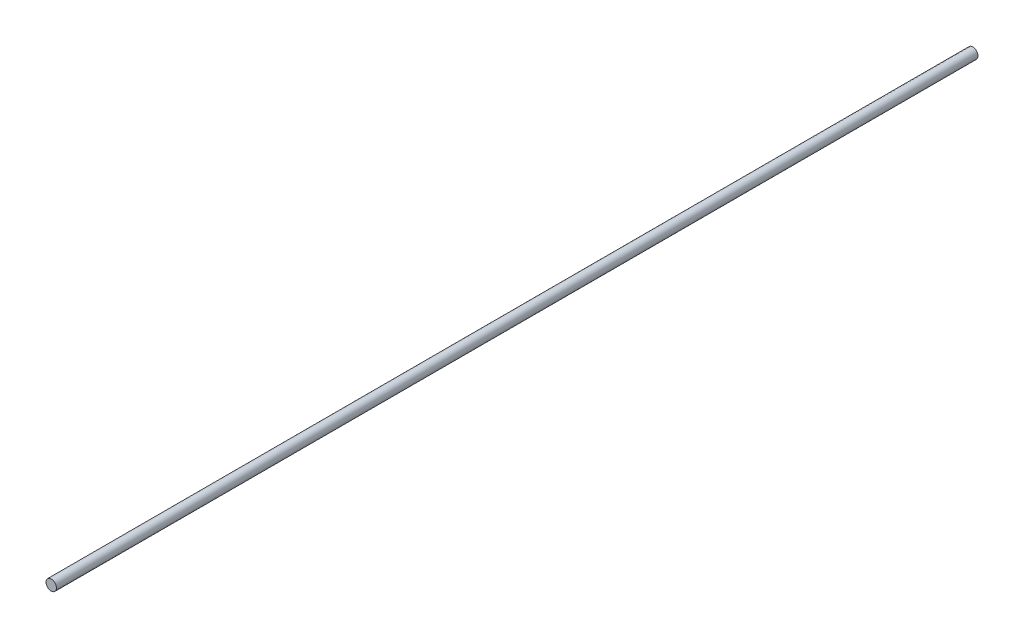
ISO-10303-21;
HEADER;
FILE_DESCRIPTION(('STEP AP214'),'2;1');
FILE_NAME('part.step','',(''),(''),'','','');
FILE_SCHEMA(('AUTOMOTIVE_DESIGN { 1 0 10303 214 1 1 1 1 }'));
ENDSEC;
DATA;
#1=APPLICATION_CONTEXT('core data for automotive mechanical design processes');
#2=APPLICATION_PROTOCOL_DEFINITION('international standard','automotive_design',2000,#1);
#3=PRODUCT_CONTEXT('',#1,'mechanical');
#4=PRODUCT('Part','Part','',(#3));
#5=PRODUCT_RELATED_PRODUCT_CATEGORY('part','',(#4));
#6=PRODUCT_DEFINITION_FORMATION('','',#4);
#7=PRODUCT_DEFINITION_CONTEXT('part definition',#1,'design');
#8=PRODUCT_DEFINITION('design','',#6,#7);
#9=PRODUCT_DEFINITION_SHAPE('','',#8);
#10=(LENGTH_UNIT() NAMED_UNIT(*) SI_UNIT(.MILLI.,.METRE.));
#11=(NAMED_UNIT(*) PLANE_ANGLE_UNIT() SI_UNIT($,.RADIAN.));
#12=(NAMED_UNIT(*) SI_UNIT($,.STERADIAN.) SOLID_ANGLE_UNIT());
#13=UNCERTAINTY_MEASURE_WITH_UNIT(LENGTH_MEASURE(1.E-05),#10,'distance_accuracy_value','');
#14=(GEOMETRIC_REPRESENTATION_CONTEXT(3) GLOBAL_UNCERTAINTY_ASSIGNED_CONTEXT((#13)) GLOBAL_UNIT_ASSIGNED_CONTEXT((#10,
#11,#12)) REPRESENTATION_CONTEXT('',''));
#15=CARTESIAN_POINT('',(0.,0.,0.));
#16=DIRECTION('',(0.,0.,1.));
#17=DIRECTION('',(1.,0.,0.));
#18=AXIS2_PLACEMENT_3D('',#15,#16,#17);
#19=CARTESIAN_POINT('',(0.,0.,-700.));
#20=DIRECTION('',(0.,0.,1.));
#21=DIRECTION('',(1.,0.,0.));
#22=AXIS2_PLACEMENT_3D('',#19,#20,#21);
#23=CYLINDRICAL_SURFACE('',#22,3.96875);
#24=CARTESIAN_POINT('',(0.,0.,-700.));
#25=DIRECTION('',(0.,0.,1.));
#26=DIRECTION('',(1.,0.,0.));
#27=AXIS2_PLACEMENT_3D('',#24,#25,#26);
#28=CIRCLE('',#27,3.96875);
#29=CARTESIAN_POINT('',(3.96875,0.,-700.));
#30=VERTEX_POINT('',#29);
#31=EDGE_CURVE('E10',#30,#30,#28,.T.);
#32=ORIENTED_EDGE('',*,*,#31,.T.);
#33=EDGE_LOOP('',(#32));
#34=FACE_BOUND('',#33,.T.);
#35=CARTESIAN_POINT('',(0.,0.,0.));
#36=DIRECTION('',(0.,0.,1.));
#37=DIRECTION('',(1.,0.,0.));
#38=AXIS2_PLACEMENT_3D('',#35,#36,#37);
#39=CIRCLE('',#38,3.96875);
#40=CARTESIAN_POINT('',(3.96875,0.,0.));
#41=VERTEX_POINT('',#40);
#42=EDGE_CURVE('E36',#41,#41,#39,.T.);
#43=ORIENTED_EDGE('',*,*,#42,.F.);
#44=EDGE_LOOP('',(#43));
#45=FACE_BOUND('',#44,.T.);
#46=ADVANCED_FACE('F33',(#34,#45),#23,.T.);
#47=CARTESIAN_POINT('',(0.,0.,-700.));
#48=DIRECTION('',(0.,0.,1.));
#49=DIRECTION('',(1.,0.,0.));
#50=AXIS2_PLACEMENT_3D('',#47,#48,#49);
#51=PLANE('',#50);
#52=ORIENTED_EDGE('',*,*,#31,.F.);
#53=EDGE_LOOP('',(#52));
#54=FACE_BOUND('',#53,.T.);
#55=ADVANCED_FACE('F48',(#54),#51,.F.);
#56=CARTESIAN_POINT('',(0.,0.,0.));
#57=DIRECTION('',(0.,0.,1.));
#58=DIRECTION('',(1.,0.,0.));
#59=AXIS2_PLACEMENT_3D('',#56,#57,#58);
#60=PLANE('',#59);
#61=ORIENTED_EDGE('',*,*,#42,.T.);
#62=EDGE_LOOP('',(#61));
#63=FACE_BOUND('',#62,.T.);
#64=ADVANCED_FACE('F45',(#63),#60,.T.);
#65=CLOSED_SHELL('',(#46,#55,#64));
#66=MANIFOLD_SOLID_BREP('B2',#65);
#67=ADVANCED_BREP_SHAPE_REPRESENTATION('',(#18,#66),#14);
#68=SHAPE_DEFINITION_REPRESENTATION(#9,#67);
ENDSEC;
END-ISO-10303-21;
